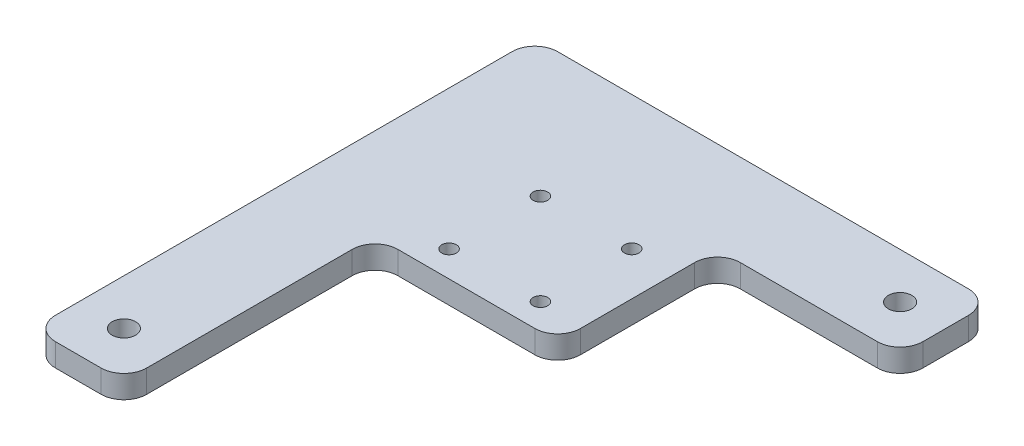
ISO-10303-21;
HEADER;
FILE_DESCRIPTION(('STEP AP214'),'2;1');
FILE_NAME('part.step','',(''),(''),'','','');
FILE_SCHEMA(('AUTOMOTIVE_DESIGN { 1 0 10303 214 1 1 1 1 }'));
ENDSEC;
DATA;
#1=APPLICATION_CONTEXT('core data for automotive mechanical design processes');
#2=APPLICATION_PROTOCOL_DEFINITION('international standard','automotive_design',2000,#1);
#3=PRODUCT_CONTEXT('',#1,'mechanical');
#4=PRODUCT('Part','Part','',(#3));
#5=PRODUCT_RELATED_PRODUCT_CATEGORY('part','',(#4));
#6=PRODUCT_DEFINITION_FORMATION('','',#4);
#7=PRODUCT_DEFINITION_CONTEXT('part definition',#1,'design');
#8=PRODUCT_DEFINITION('design','',#6,#7);
#9=PRODUCT_DEFINITION_SHAPE('','',#8);
#10=(LENGTH_UNIT() NAMED_UNIT(*) SI_UNIT(.MILLI.,.METRE.));
#11=(NAMED_UNIT(*) PLANE_ANGLE_UNIT() SI_UNIT($,.RADIAN.));
#12=(NAMED_UNIT(*) SI_UNIT($,.STERADIAN.) SOLID_ANGLE_UNIT());
#13=UNCERTAINTY_MEASURE_WITH_UNIT(LENGTH_MEASURE(1.E-05),#10,'distance_accuracy_value','');
#14=(GEOMETRIC_REPRESENTATION_CONTEXT(3) GLOBAL_UNCERTAINTY_ASSIGNED_CONTEXT((#13)) GLOBAL_UNIT_ASSIGNED_CONTEXT((#10,
#11,#12)) REPRESENTATION_CONTEXT('',''));
#15=CARTESIAN_POINT('',(0.,0.,0.));
#16=DIRECTION('',(0.,0.,1.));
#17=DIRECTION('',(1.,0.,0.));
#18=AXIS2_PLACEMENT_3D('',#15,#16,#17);
#19=CARTESIAN_POINT('',(0.,6.35,0.));
#20=DIRECTION('',(0.,-1.,0.));
#21=DIRECTION('',(0.,0.,-1.));
#22=AXIS2_PLACEMENT_3D('',#19,#20,#21);
#23=PLANE('',#22);
#24=CARTESIAN_POINT('',(-15.1823734729494,6.35,-16.8027870855148));
#25=DIRECTION('',(0.,1.,0.));
#26=DIRECTION('',(0.,0.,1.));
#27=AXIS2_PLACEMENT_3D('',#24,#25,#26);
#28=CIRCLE('',#27,2.01929999999999);
#29=CARTESIAN_POINT('',(-15.1823734729494,6.35,-14.7834870855148));
#30=VERTEX_POINT('',#29);
#31=EDGE_CURVE('E455',#30,#30,#28,.T.);
#32=ORIENTED_EDGE('',*,*,#31,.F.);
#33=EDGE_LOOP('',(#32));
#34=FACE_BOUND('',#33,.T.);
#35=CARTESIAN_POINT('',(-15.1823734729494,6.35,8.59721291448517));
#36=DIRECTION('',(0.,1.,0.));
#37=DIRECTION('',(0.,0.,1.));
#38=AXIS2_PLACEMENT_3D('',#35,#36,#37);
#39=CIRCLE('',#38,2.01929999999999);
#40=CARTESIAN_POINT('',(-15.1823734729494,6.35,10.6165129144852));
#41=VERTEX_POINT('',#40);
#42=EDGE_CURVE('E459',#41,#41,#39,.T.);
#43=ORIENTED_EDGE('',*,*,#42,.F.);
#44=EDGE_LOOP('',(#43));
#45=FACE_BOUND('',#44,.T.);
#46=CARTESIAN_POINT('',(10.2176265270506,6.35,8.59721291448517));
#47=DIRECTION('',(0.,1.,0.));
#48=DIRECTION('',(0.,0.,1.));
#49=AXIS2_PLACEMENT_3D('',#46,#47,#48);
#50=CIRCLE('',#49,2.01929999999999);
#51=CARTESIAN_POINT('',(10.2176265270506,6.35,10.6165129144852));
#52=VERTEX_POINT('',#51);
#53=EDGE_CURVE('E469',#52,#52,#50,.T.);
#54=ORIENTED_EDGE('',*,*,#53,.F.);
#55=EDGE_LOOP('',(#54));
#56=FACE_BOUND('',#55,.T.);
#57=CARTESIAN_POINT('',(10.2176265270506,6.35,-16.8027870855148));
#58=DIRECTION('',(0.,1.,0.));
#59=DIRECTION('',(0.,0.,1.));
#60=AXIS2_PLACEMENT_3D('',#57,#58,#59);
#61=CIRCLE('',#60,2.01929999999999);
#62=CARTESIAN_POINT('',(10.2176265270506,6.35,-14.7834870855148));
#63=VERTEX_POINT('',#62);
#64=EDGE_CURVE('E477',#63,#63,#61,.T.);
#65=ORIENTED_EDGE('',*,*,#64,.F.);
#66=EDGE_LOOP('',(#65));
#67=FACE_BOUND('',#66,.T.);
#68=DIRECTION('',(0.,0.,-1.));
#69=VECTOR('',#68,1.);
#70=CARTESIAN_POINT('',(73.0584040710506,6.35,-54.0137870855148));
#71=LINE('',#70,#69);
#72=CARTESIAN_POINT('',(73.0584040710506,6.35,-34.9637870855148));
#73=VERTEX_POINT('',#72);
#74=CARTESIAN_POINT('',(73.0584040710506,6.35,-47.6637870855148));
#75=VERTEX_POINT('',#74);
#76=EDGE_CURVE('E298',#73,#75,#71,.T.);
#77=ORIENTED_EDGE('',*,*,#76,.T.);
#78=CARTESIAN_POINT('',(66.7084040710506,6.35,-47.6637870855148));
#79=DIRECTION('',(0.,-1.,0.));
#80=DIRECTION('',(0.,0.,-1.));
#81=AXIS2_PLACEMENT_3D('',#78,#79,#80);
#82=CIRCLE('',#81,6.35);
#83=CARTESIAN_POINT('',(66.7084040710506,6.35,-54.0137870855148));
#84=VERTEX_POINT('',#83);
#85=EDGE_CURVE('E11',#75,#84,#82,.F.);
#86=ORIENTED_EDGE('',*,*,#85,.T.);
#87=DIRECTION('',(-1.,0.,0.));
#88=VECTOR('',#87,1.);
#89=CARTESIAN_POINT('',(-53.9415959289494,6.35,-54.0137870855148));
#90=LINE('',#89,#88);
#91=CARTESIAN_POINT('',(-47.5915959289494,6.35,-54.0137870855148));
#92=VERTEX_POINT('',#91);
#93=EDGE_CURVE('E295',#84,#92,#90,.T.);
#94=ORIENTED_EDGE('',*,*,#93,.T.);
#95=CARTESIAN_POINT('',(-47.5915959289494,6.35,-47.6637870855148));
#96=DIRECTION('',(0.,-1.,0.));
#97=DIRECTION('',(0.,0.,-1.));
#98=AXIS2_PLACEMENT_3D('',#95,#96,#97);
#99=CIRCLE('',#98,6.35);
#100=CARTESIAN_POINT('',(-53.9415959289494,6.35,-47.6637870855148));
#101=VERTEX_POINT('',#100);
#102=EDGE_CURVE('E209',#92,#101,#99,.F.);
#103=ORIENTED_EDGE('',*,*,#102,.T.);
#104=DIRECTION('',(0.,0.,1.));
#105=VECTOR('',#104,1.);
#106=CARTESIAN_POINT('',(-53.9415959289494,6.35,85.6862129144852));
#107=LINE('',#106,#105);
#108=CARTESIAN_POINT('',(-53.9415959289494,6.35,79.3362129144852));
#109=VERTEX_POINT('',#108);
#110=EDGE_CURVE('E291',#101,#109,#107,.T.);
#111=ORIENTED_EDGE('',*,*,#110,.T.);
#112=CARTESIAN_POINT('',(-47.5915959289494,6.35,79.3362129144852));
#113=DIRECTION('',(0.,-1.,0.));
#114=DIRECTION('',(0.,0.,-1.));
#115=AXIS2_PLACEMENT_3D('',#112,#113,#114);
#116=CIRCLE('',#115,6.35);
#117=CARTESIAN_POINT('',(-47.5915959289494,6.35,85.6862129144852));
#118=VERTEX_POINT('',#117);
#119=EDGE_CURVE('E222',#109,#118,#116,.F.);
#120=ORIENTED_EDGE('',*,*,#119,.T.);
#121=DIRECTION('',(1.,0.,0.));
#122=VECTOR('',#121,1.);
#123=CARTESIAN_POINT('',(-53.9415959289494,6.35,85.6862129144852));
#124=LINE('',#123,#122);
#125=CARTESIAN_POINT('',(-34.8915959289494,6.35,85.6862129144852));
#126=VERTEX_POINT('',#125);
#127=EDGE_CURVE('E287',#118,#126,#124,.T.);
#128=ORIENTED_EDGE('',*,*,#127,.T.);
#129=CARTESIAN_POINT('',(-34.8915959289494,6.35,79.3362129144852));
#130=DIRECTION('',(0.,-1.,0.));
#131=DIRECTION('',(0.,0.,-1.));
#132=AXIS2_PLACEMENT_3D('',#129,#130,#131);
#133=CIRCLE('',#132,6.35);
#134=CARTESIAN_POINT('',(-28.5415959289494,6.35,79.3362129144852));
#135=VERTEX_POINT('',#134);
#136=EDGE_CURVE('E235',#126,#135,#133,.F.);
#137=ORIENTED_EDGE('',*,*,#136,.T.);
#138=DIRECTION('',(0.,0.,-1.));
#139=VECTOR('',#138,1.);
#140=CARTESIAN_POINT('',(-28.5415959289494,6.35,15.8362129144852));
#141=LINE('',#140,#139);
#142=CARTESIAN_POINT('',(-28.5415959289494,6.35,22.1862129144852));
#143=VERTEX_POINT('',#142);
#144=EDGE_CURVE('E284',#135,#143,#141,.T.);
#145=ORIENTED_EDGE('',*,*,#144,.T.);
#146=CARTESIAN_POINT('',(-22.1915959289494,6.35,22.1862129144852));
#147=DIRECTION('',(0.,-1.,0.));
#148=DIRECTION('',(0.,0.,-1.));
#149=AXIS2_PLACEMENT_3D('',#146,#147,#148);
#150=CIRCLE('',#149,6.35);
#151=CARTESIAN_POINT('',(-22.1915959289494,6.35,15.8362129144852));
#152=VERTEX_POINT('',#151);
#153=EDGE_CURVE('E164',#143,#152,#150,.T.);
#154=ORIENTED_EDGE('',*,*,#153,.T.);
#155=DIRECTION('',(1.,0.,0.));
#156=VECTOR('',#155,1.);
#157=CARTESIAN_POINT('',(22.2584040710506,6.35,15.8362129144852));
#158=LINE('',#157,#156);
#159=CARTESIAN_POINT('',(15.9084040710506,6.35,15.8362129144852));
#160=VERTEX_POINT('',#159);
#161=EDGE_CURVE('E173',#152,#160,#158,.T.);
#162=ORIENTED_EDGE('',*,*,#161,.T.);
#163=CARTESIAN_POINT('',(15.9084040710506,6.35,9.48621291448515));
#164=DIRECTION('',(0.,-1.,0.));
#165=DIRECTION('',(0.,0.,-1.));
#166=AXIS2_PLACEMENT_3D('',#163,#164,#165);
#167=CIRCLE('',#166,6.35);
#168=CARTESIAN_POINT('',(22.2584040710506,6.35,9.48621291448515));
#169=VERTEX_POINT('',#168);
#170=EDGE_CURVE('E247',#160,#169,#167,.F.);
#171=ORIENTED_EDGE('',*,*,#170,.T.);
#172=DIRECTION('',(0.,0.,-1.));
#173=VECTOR('',#172,1.);
#174=CARTESIAN_POINT('',(22.2584040710506,6.35,15.8362129144852));
#175=LINE('',#174,#173);
#176=CARTESIAN_POINT('',(22.2584040710506,6.35,-22.2637870855148));
#177=VERTEX_POINT('',#176);
#178=EDGE_CURVE('E181',#169,#177,#175,.T.);
#179=ORIENTED_EDGE('',*,*,#178,.T.);
#180=CARTESIAN_POINT('',(28.6084040710506,6.35,-22.2637870855148));
#181=DIRECTION('',(0.,-1.,0.));
#182=DIRECTION('',(0.,0.,-1.));
#183=AXIS2_PLACEMENT_3D('',#180,#181,#182);
#184=CIRCLE('',#183,6.35);
#185=CARTESIAN_POINT('',(28.6084040710506,6.35,-28.6137870855148));
#186=VERTEX_POINT('',#185);
#187=EDGE_CURVE('E260',#177,#186,#184,.T.);
#188=ORIENTED_EDGE('',*,*,#187,.T.);
#189=DIRECTION('',(1.,0.,0.));
#190=VECTOR('',#189,1.);
#191=CARTESIAN_POINT('',(22.2584040710506,6.35,-28.6137870855148));
#192=LINE('',#191,#190);
#193=CARTESIAN_POINT('',(66.7084040710506,6.35,-28.6137870855148));
#194=VERTEX_POINT('',#193);
#195=EDGE_CURVE('E187',#186,#194,#192,.T.);
#196=ORIENTED_EDGE('',*,*,#195,.T.);
#197=CARTESIAN_POINT('',(66.7084040710506,6.35,-34.9637870855148));
#198=DIRECTION('',(0.,-1.,0.));
#199=DIRECTION('',(0.,0.,-1.));
#200=AXIS2_PLACEMENT_3D('',#197,#198,#199);
#201=CIRCLE('',#200,6.35);
#202=EDGE_CURVE('E273',#194,#73,#201,.F.);
#203=ORIENTED_EDGE('',*,*,#202,.T.);
#204=EDGE_LOOP('',(#77,#86,#94,#103,#111,#120,#128,#137,#145,#154,#162,#171,#179,#188,#196,#203));
#205=FACE_BOUND('',#204,.T.);
#206=CARTESIAN_POINT('',(-41.2415959289494,6.35,72.9862129144852));
#207=DIRECTION('',(0.,1.,0.));
#208=DIRECTION('',(0.,0.,1.));
#209=AXIS2_PLACEMENT_3D('',#206,#207,#208);
#210=CIRCLE('',#209,3.2639);
#211=CARTESIAN_POINT('',(-41.2415959289494,6.35,76.2501129144852));
#212=VERTEX_POINT('',#211);
#213=EDGE_CURVE('E314',#212,#212,#210,.T.);
#214=ORIENTED_EDGE('',*,*,#213,.F.);
#215=EDGE_LOOP('',(#214));
#216=FACE_BOUND('',#215,.T.);
#217=CARTESIAN_POINT('',(60.3584040710506,6.35,-41.3137870855148));
#218=DIRECTION('',(0.,1.,0.));
#219=DIRECTION('',(0.,0.,1.));
#220=AXIS2_PLACEMENT_3D('',#217,#218,#219);
#221=CIRCLE('',#220,3.26389999999999);
#222=CARTESIAN_POINT('',(60.3584040710506,6.35,-38.0498870855148));
#223=VERTEX_POINT('',#222);
#224=EDGE_CURVE('E486',#223,#223,#221,.T.);
#225=ORIENTED_EDGE('',*,*,#224,.F.);
#226=EDGE_LOOP('',(#225));
#227=FACE_BOUND('',#226,.T.);
#228=ADVANCED_FACE('F39',(#34,#45,#56,#67,#205,#216,#227),#23,.F.);
#229=CARTESIAN_POINT('',(0.,0.,0.));
#230=DIRECTION('',(0.,-1.,0.));
#231=DIRECTION('',(0.,0.,-1.));
#232=AXIS2_PLACEMENT_3D('',#229,#230,#231);
#233=PLANE('',#232);
#234=CARTESIAN_POINT('',(-15.1823734729494,0.,-16.8027870855148));
#235=DIRECTION('',(0.,1.,0.));
#236=DIRECTION('',(0.,0.,1.));
#237=AXIS2_PLACEMENT_3D('',#234,#235,#236);
#238=CIRCLE('',#237,2.0193);
#239=CARTESIAN_POINT('',(-15.1823734729494,0.,-14.7834870855148));
#240=VERTEX_POINT('',#239);
#241=EDGE_CURVE('E453',#240,#240,#238,.T.);
#242=ORIENTED_EDGE('',*,*,#241,.T.);
#243=EDGE_LOOP('',(#242));
#244=FACE_BOUND('',#243,.T.);
#245=CARTESIAN_POINT('',(-15.1823734729494,0.,8.59721291448517));
#246=DIRECTION('',(0.,1.,0.));
#247=DIRECTION('',(0.,0.,1.));
#248=AXIS2_PLACEMENT_3D('',#245,#246,#247);
#249=CIRCLE('',#248,2.0193);
#250=CARTESIAN_POINT('',(-15.1823734729494,0.,10.6165129144852));
#251=VERTEX_POINT('',#250);
#252=EDGE_CURVE('E465',#251,#251,#249,.T.);
#253=ORIENTED_EDGE('',*,*,#252,.T.);
#254=EDGE_LOOP('',(#253));
#255=FACE_BOUND('',#254,.T.);
#256=CARTESIAN_POINT('',(10.2176265270506,0.,8.59721291448517));
#257=DIRECTION('',(0.,1.,0.));
#258=DIRECTION('',(0.,0.,1.));
#259=AXIS2_PLACEMENT_3D('',#256,#257,#258);
#260=CIRCLE('',#259,2.0193);
#261=CARTESIAN_POINT('',(10.2176265270506,0.,10.6165129144852));
#262=VERTEX_POINT('',#261);
#263=EDGE_CURVE('E473',#262,#262,#260,.T.);
#264=ORIENTED_EDGE('',*,*,#263,.T.);
#265=EDGE_LOOP('',(#264));
#266=FACE_BOUND('',#265,.T.);
#267=CARTESIAN_POINT('',(10.2176265270506,0.,-16.8027870855148));
#268=DIRECTION('',(0.,1.,0.));
#269=DIRECTION('',(0.,0.,1.));
#270=AXIS2_PLACEMENT_3D('',#267,#268,#269);
#271=CIRCLE('',#270,2.0193);
#272=CARTESIAN_POINT('',(10.2176265270506,0.,-14.7834870855148));
#273=VERTEX_POINT('',#272);
#274=EDGE_CURVE('E481',#273,#273,#271,.T.);
#275=ORIENTED_EDGE('',*,*,#274,.T.);
#276=EDGE_LOOP('',(#275));
#277=FACE_BOUND('',#276,.T.);
#278=CARTESIAN_POINT('',(-41.2415959289494,0.,72.9862129144852));
#279=DIRECTION('',(0.,1.,0.));
#280=DIRECTION('',(0.,0.,1.));
#281=AXIS2_PLACEMENT_3D('',#278,#279,#280);
#282=CIRCLE('',#281,3.2639);
#283=CARTESIAN_POINT('',(-41.2415959289494,0.,76.2501129144852));
#284=VERTEX_POINT('',#283);
#285=EDGE_CURVE('E489',#284,#284,#282,.T.);
#286=ORIENTED_EDGE('',*,*,#285,.T.);
#287=EDGE_LOOP('',(#286));
#288=FACE_BOUND('',#287,.T.);
#289=DIRECTION('',(-1.,0.,0.));
#290=VECTOR('',#289,1.);
#291=CARTESIAN_POINT('',(-53.9415959289494,0.,-54.0137870855148));
#292=LINE('',#291,#290);
#293=CARTESIAN_POINT('',(66.7084040710506,0.,-54.0137870855148));
#294=VERTEX_POINT('',#293);
#295=CARTESIAN_POINT('',(-47.5915959289494,0.,-54.0137870855148));
#296=VERTEX_POINT('',#295);
#297=EDGE_CURVE('E321',#294,#296,#292,.T.);
#298=ORIENTED_EDGE('',*,*,#297,.F.);
#299=CARTESIAN_POINT('',(66.7084040710506,0.,-47.6637870855148));
#300=DIRECTION('',(0.,-1.,0.));
#301=DIRECTION('',(0.,0.,-1.));
#302=AXIS2_PLACEMENT_3D('',#299,#300,#301);
#303=CIRCLE('',#302,6.35);
#304=CARTESIAN_POINT('',(73.0584040710506,0.,-47.6637870855148));
#305=VERTEX_POINT('',#304);
#306=EDGE_CURVE('E62',#294,#305,#303,.T.);
#307=ORIENTED_EDGE('',*,*,#306,.T.);
#308=DIRECTION('',(0.,0.,-1.));
#309=VECTOR('',#308,1.);
#310=CARTESIAN_POINT('',(73.0584040710506,0.,-54.0137870855148));
#311=LINE('',#310,#309);
#312=CARTESIAN_POINT('',(73.0584040710506,0.,-34.9637870855148));
#313=VERTEX_POINT('',#312);
#314=EDGE_CURVE('E318',#313,#305,#311,.T.);
#315=ORIENTED_EDGE('',*,*,#314,.F.);
#316=CARTESIAN_POINT('',(66.7084040710506,0.,-34.9637870855148));
#317=DIRECTION('',(0.,-1.,0.));
#318=DIRECTION('',(0.,0.,-1.));
#319=AXIS2_PLACEMENT_3D('',#316,#317,#318);
#320=CIRCLE('',#319,6.35);
#321=CARTESIAN_POINT('',(66.7084040710506,0.,-28.6137870855148));
#322=VERTEX_POINT('',#321);
#323=EDGE_CURVE('E267',#313,#322,#320,.T.);
#324=ORIENTED_EDGE('',*,*,#323,.T.);
#325=DIRECTION('',(1.,0.,0.));
#326=VECTOR('',#325,1.);
#327=CARTESIAN_POINT('',(22.2584040710506,0.,-28.6137870855148));
#328=LINE('',#327,#326);
#329=CARTESIAN_POINT('',(28.6084040710506,0.,-28.6137870855148));
#330=VERTEX_POINT('',#329);
#331=EDGE_CURVE('E313',#330,#322,#328,.T.);
#332=ORIENTED_EDGE('',*,*,#331,.F.);
#333=CARTESIAN_POINT('',(28.6084040710506,0.,-22.2637870855148));
#334=DIRECTION('',(0.,-1.,0.));
#335=DIRECTION('',(0.,0.,-1.));
#336=AXIS2_PLACEMENT_3D('',#333,#334,#335);
#337=CIRCLE('',#336,6.35);
#338=CARTESIAN_POINT('',(22.2584040710506,0.,-22.2637870855148));
#339=VERTEX_POINT('',#338);
#340=EDGE_CURVE('E257',#330,#339,#337,.F.);
#341=ORIENTED_EDGE('',*,*,#340,.T.);
#342=DIRECTION('',(0.,0.,-1.));
#343=VECTOR('',#342,1.);
#344=CARTESIAN_POINT('',(22.2584040710506,0.,15.8362129144852));
#345=LINE('',#344,#343);
#346=CARTESIAN_POINT('',(22.2584040710506,0.,9.48621291448515));
#347=VERTEX_POINT('',#346);
#348=EDGE_CURVE('E309',#347,#339,#345,.T.);
#349=ORIENTED_EDGE('',*,*,#348,.F.);
#350=CARTESIAN_POINT('',(15.9084040710506,0.,9.48621291448515));
#351=DIRECTION('',(0.,-1.,0.));
#352=DIRECTION('',(0.,0.,-1.));
#353=AXIS2_PLACEMENT_3D('',#350,#351,#352);
#354=CIRCLE('',#353,6.35);
#355=CARTESIAN_POINT('',(15.9084040710506,0.,15.8362129144852));
#356=VERTEX_POINT('',#355);
#357=EDGE_CURVE('E179',#347,#356,#354,.T.);
#358=ORIENTED_EDGE('',*,*,#357,.T.);
#359=DIRECTION('',(1.,0.,0.));
#360=VECTOR('',#359,1.);
#361=CARTESIAN_POINT('',(22.2584040710506,0.,15.8362129144852));
#362=LINE('',#361,#360);
#363=CARTESIAN_POINT('',(-22.1915959289494,0.,15.8362129144852));
#364=VERTEX_POINT('',#363);
#365=EDGE_CURVE('E170',#364,#356,#362,.T.);
#366=ORIENTED_EDGE('',*,*,#365,.F.);
#367=CARTESIAN_POINT('',(-22.1915959289494,0.,22.1862129144852));
#368=DIRECTION('',(0.,-1.,0.));
#369=DIRECTION('',(0.,0.,-1.));
#370=AXIS2_PLACEMENT_3D('',#367,#368,#369);
#371=CIRCLE('',#370,6.35);
#372=CARTESIAN_POINT('',(-28.5415959289494,0.,22.1862129144852));
#373=VERTEX_POINT('',#372);
#374=EDGE_CURVE('E154',#364,#373,#371,.F.);
#375=ORIENTED_EDGE('',*,*,#374,.T.);
#376=DIRECTION('',(0.,0.,-1.));
#377=VECTOR('',#376,1.);
#378=CARTESIAN_POINT('',(-28.5415959289494,0.,15.8362129144852));
#379=LINE('',#378,#377);
#380=CARTESIAN_POINT('',(-28.5415959289494,0.,79.3362129144852));
#381=VERTEX_POINT('',#380);
#382=EDGE_CURVE('E182',#381,#373,#379,.T.);
#383=ORIENTED_EDGE('',*,*,#382,.F.);
#384=CARTESIAN_POINT('',(-34.8915959289494,0.,79.3362129144852));
#385=DIRECTION('',(0.,-1.,0.));
#386=DIRECTION('',(0.,0.,-1.));
#387=AXIS2_PLACEMENT_3D('',#384,#385,#386);
#388=CIRCLE('',#387,6.35);
#389=CARTESIAN_POINT('',(-34.8915959289494,0.,85.6862129144852));
#390=VERTEX_POINT('',#389);
#391=EDGE_CURVE('E229',#381,#390,#388,.T.);
#392=ORIENTED_EDGE('',*,*,#391,.T.);
#393=DIRECTION('',(1.,0.,0.));
#394=VECTOR('',#393,1.);
#395=CARTESIAN_POINT('',(-53.9415959289494,0.,85.6862129144852));
#396=LINE('',#395,#394);
#397=CARTESIAN_POINT('',(-47.5915959289494,0.,85.6862129144852));
#398=VERTEX_POINT('',#397);
#399=EDGE_CURVE('E189',#398,#390,#396,.T.);
#400=ORIENTED_EDGE('',*,*,#399,.F.);
#401=CARTESIAN_POINT('',(-47.5915959289494,0.,79.3362129144852));
#402=DIRECTION('',(0.,-1.,0.));
#403=DIRECTION('',(0.,0.,-1.));
#404=AXIS2_PLACEMENT_3D('',#401,#402,#403);
#405=CIRCLE('',#404,6.35);
#406=CARTESIAN_POINT('',(-53.9415959289494,0.,79.3362129144852));
#407=VERTEX_POINT('',#406);
#408=EDGE_CURVE('E216',#398,#407,#405,.T.);
#409=ORIENTED_EDGE('',*,*,#408,.T.);
#410=DIRECTION('',(0.,0.,1.));
#411=VECTOR('',#410,1.);
#412=CARTESIAN_POINT('',(-53.9415959289494,0.,85.6862129144852));
#413=LINE('',#412,#411);
#414=CARTESIAN_POINT('',(-53.9415959289494,0.,-47.6637870855148));
#415=VERTEX_POINT('',#414);
#416=EDGE_CURVE('E324',#415,#407,#413,.T.);
#417=ORIENTED_EDGE('',*,*,#416,.F.);
#418=CARTESIAN_POINT('',(-47.5915959289494,0.,-47.6637870855148));
#419=DIRECTION('',(0.,-1.,0.));
#420=DIRECTION('',(0.,0.,-1.));
#421=AXIS2_PLACEMENT_3D('',#418,#419,#420);
#422=CIRCLE('',#421,6.35);
#423=EDGE_CURVE('E201',#415,#296,#422,.T.);
#424=ORIENTED_EDGE('',*,*,#423,.T.);
#425=EDGE_LOOP('',(#298,#307,#315,#324,#332,#341,#349,#358,#366,#375,#383,#392,#400,#409,#417,#424));
#426=FACE_BOUND('',#425,.T.);
#427=CARTESIAN_POINT('',(60.3584040710506,0.,-41.3137870855148));
#428=DIRECTION('',(0.,1.,0.));
#429=DIRECTION('',(0.,0.,1.));
#430=AXIS2_PLACEMENT_3D('',#427,#428,#429);
#431=CIRCLE('',#430,3.26389999999999);
#432=CARTESIAN_POINT('',(60.3584040710506,0.,-38.0498870855148));
#433=VERTEX_POINT('',#432);
#434=EDGE_CURVE('E485',#433,#433,#431,.T.);
#435=ORIENTED_EDGE('',*,*,#434,.T.);
#436=EDGE_LOOP('',(#435));
#437=FACE_BOUND('',#436,.T.);
#438=ADVANCED_FACE('F176',(#244,#255,#266,#277,#288,#426,#437),#233,.T.);
#439=CARTESIAN_POINT('',(22.2584040710506,6.35,15.8362129144852));
#440=DIRECTION('',(-1.,0.,0.));
#441=DIRECTION('',(0.,0.,1.));
#442=AXIS2_PLACEMENT_3D('',#439,#440,#441);
#443=PLANE('',#442);
#444=ORIENTED_EDGE('',*,*,#348,.T.);
#445=DIRECTION('',(0.,-1.,0.));
#446=VECTOR('',#445,1.);
#447=CARTESIAN_POINT('',(22.2584040710506,6.35,-22.2637870855148));
#448=LINE('',#447,#446);
#449=EDGE_CURVE('E254',#339,#177,#448,.F.);
#450=ORIENTED_EDGE('',*,*,#449,.T.);
#451=ORIENTED_EDGE('',*,*,#178,.F.);
#452=DIRECTION('',(0.,-1.,0.));
#453=VECTOR('',#452,1.);
#454=CARTESIAN_POINT('',(22.2584040710506,6.35,9.48621291448515));
#455=LINE('',#454,#453);
#456=EDGE_CURVE('E238',#169,#347,#455,.T.);
#457=ORIENTED_EDGE('',*,*,#456,.T.);
#458=EDGE_LOOP('',(#444,#450,#451,#457));
#459=FACE_BOUND('',#458,.T.);
#460=ADVANCED_FACE('F349',(#459),#443,.F.);
#461=CARTESIAN_POINT('',(22.2584040710506,6.35,-28.6137870855148));
#462=DIRECTION('',(0.,0.,-1.));
#463=DIRECTION('',(-1.,0.,0.));
#464=AXIS2_PLACEMENT_3D('',#461,#462,#463);
#465=PLANE('',#464);
#466=ORIENTED_EDGE('',*,*,#331,.T.);
#467=DIRECTION('',(0.,-1.,0.));
#468=VECTOR('',#467,1.);
#469=CARTESIAN_POINT('',(66.7084040710506,6.35,-28.6137870855148));
#470=LINE('',#469,#468);
#471=EDGE_CURVE('E270',#322,#194,#470,.F.);
#472=ORIENTED_EDGE('',*,*,#471,.T.);
#473=ORIENTED_EDGE('',*,*,#195,.F.);
#474=DIRECTION('',(0.,-1.,0.));
#475=VECTOR('',#474,1.);
#476=CARTESIAN_POINT('',(28.6084040710506,0.,-28.6137870855148));
#477=LINE('',#476,#475);
#478=EDGE_CURVE('E250',#186,#330,#477,.T.);
#479=ORIENTED_EDGE('',*,*,#478,.T.);
#480=EDGE_LOOP('',(#466,#472,#473,#479));
#481=FACE_BOUND('',#480,.T.);
#482=ADVANCED_FACE('F357',(#481),#465,.F.);
#483=CARTESIAN_POINT('',(73.0584040710506,6.35,-54.0137870855148));
#484=DIRECTION('',(-1.,0.,0.));
#485=DIRECTION('',(0.,0.,1.));
#486=AXIS2_PLACEMENT_3D('',#483,#484,#485);
#487=PLANE('',#486);
#488=ORIENTED_EDGE('',*,*,#314,.T.);
#489=DIRECTION('',(0.,-1.,0.));
#490=VECTOR('',#489,1.);
#491=CARTESIAN_POINT('',(73.0584040710506,6.35,-47.6637870855148));
#492=LINE('',#491,#490);
#493=EDGE_CURVE('E48',#305,#75,#492,.F.);
#494=ORIENTED_EDGE('',*,*,#493,.T.);
#495=ORIENTED_EDGE('',*,*,#76,.F.);
#496=DIRECTION('',(0.,-1.,0.));
#497=VECTOR('',#496,1.);
#498=CARTESIAN_POINT('',(73.0584040710506,6.35,-34.9637870855148));
#499=LINE('',#498,#497);
#500=EDGE_CURVE('E263',#73,#313,#499,.T.);
#501=ORIENTED_EDGE('',*,*,#500,.T.);
#502=EDGE_LOOP('',(#488,#494,#495,#501));
#503=FACE_BOUND('',#502,.T.);
#504=ADVANCED_FACE('F363',(#503),#487,.F.);
#505=CARTESIAN_POINT('',(-53.9415959289494,6.35,-54.0137870855148));
#506=DIRECTION('',(0.,0.,1.));
#507=DIRECTION('',(1.,0.,0.));
#508=AXIS2_PLACEMENT_3D('',#505,#506,#507);
#509=PLANE('',#508);
#510=ORIENTED_EDGE('',*,*,#93,.F.);
#511=DIRECTION('',(0.,-1.,0.));
#512=VECTOR('',#511,1.);
#513=CARTESIAN_POINT('',(66.7084040710506,6.35,-54.0137870855148));
#514=LINE('',#513,#512);
#515=EDGE_CURVE('E276',#84,#294,#514,.T.);
#516=ORIENTED_EDGE('',*,*,#515,.T.);
#517=ORIENTED_EDGE('',*,*,#297,.T.);
#518=DIRECTION('',(0.,-1.,0.));
#519=VECTOR('',#518,1.);
#520=CARTESIAN_POINT('',(-47.5915959289494,6.35,-54.0137870855148));
#521=LINE('',#520,#519);
#522=EDGE_CURVE('E205',#296,#92,#521,.F.);
#523=ORIENTED_EDGE('',*,*,#522,.T.);
#524=EDGE_LOOP('',(#510,#516,#517,#523));
#525=FACE_BOUND('',#524,.T.);
#526=ADVANCED_FACE('F368',(#525),#509,.F.);
#527=CARTESIAN_POINT('',(-53.9415959289494,6.35,85.6862129144852));
#528=DIRECTION('',(1.,0.,0.));
#529=DIRECTION('',(0.,0.,-1.));
#530=AXIS2_PLACEMENT_3D('',#527,#528,#529);
#531=PLANE('',#530);
#532=ORIENTED_EDGE('',*,*,#416,.T.);
#533=DIRECTION('',(0.,-1.,0.));
#534=VECTOR('',#533,1.);
#535=CARTESIAN_POINT('',(-53.9415959289494,6.35,79.3362129144852));
#536=LINE('',#535,#534);
#537=EDGE_CURVE('E219',#407,#109,#536,.F.);
#538=ORIENTED_EDGE('',*,*,#537,.T.);
#539=ORIENTED_EDGE('',*,*,#110,.F.);
#540=DIRECTION('',(0.,-1.,0.));
#541=VECTOR('',#540,1.);
#542=CARTESIAN_POINT('',(-53.9415959289494,6.35,-47.6637870855148));
#543=LINE('',#542,#541);
#544=EDGE_CURVE('E197',#101,#415,#543,.T.);
#545=ORIENTED_EDGE('',*,*,#544,.T.);
#546=EDGE_LOOP('',(#532,#538,#539,#545));
#547=FACE_BOUND('',#546,.T.);
#548=ADVANCED_FACE('F377',(#547),#531,.F.);
#549=CARTESIAN_POINT('',(-53.9415959289494,6.35,85.6862129144852));
#550=DIRECTION('',(0.,0.,-1.));
#551=DIRECTION('',(-1.,0.,0.));
#552=AXIS2_PLACEMENT_3D('',#549,#550,#551);
#553=PLANE('',#552);
#554=ORIENTED_EDGE('',*,*,#399,.T.);
#555=DIRECTION('',(0.,-1.,0.));
#556=VECTOR('',#555,1.);
#557=CARTESIAN_POINT('',(-34.8915959289494,6.35,85.6862129144852));
#558=LINE('',#557,#556);
#559=EDGE_CURVE('E232',#390,#126,#558,.F.);
#560=ORIENTED_EDGE('',*,*,#559,.T.);
#561=ORIENTED_EDGE('',*,*,#127,.F.);
#562=DIRECTION('',(0.,-1.,0.));
#563=VECTOR('',#562,1.);
#564=CARTESIAN_POINT('',(-47.5915959289494,6.35,85.6862129144852));
#565=LINE('',#564,#563);
#566=EDGE_CURVE('E212',#118,#398,#565,.T.);
#567=ORIENTED_EDGE('',*,*,#566,.T.);
#568=EDGE_LOOP('',(#554,#560,#561,#567));
#569=FACE_BOUND('',#568,.T.);
#570=ADVANCED_FACE('F332',(#569),#553,.F.);
#571=CARTESIAN_POINT('',(-28.5415959289494,6.35,15.8362129144852));
#572=DIRECTION('',(-1.,0.,0.));
#573=DIRECTION('',(0.,0.,1.));
#574=AXIS2_PLACEMENT_3D('',#571,#572,#573);
#575=PLANE('',#574);
#576=ORIENTED_EDGE('',*,*,#144,.F.);
#577=DIRECTION('',(0.,-1.,0.));
#578=VECTOR('',#577,1.);
#579=CARTESIAN_POINT('',(-28.5415959289494,6.35,79.3362129144852));
#580=LINE('',#579,#578);
#581=EDGE_CURVE('E225',#135,#381,#580,.T.);
#582=ORIENTED_EDGE('',*,*,#581,.T.);
#583=ORIENTED_EDGE('',*,*,#382,.T.);
#584=DIRECTION('',(0.,-1.,0.));
#585=VECTOR('',#584,1.);
#586=CARTESIAN_POINT('',(-28.5415959289494,6.35,22.1862129144852));
#587=LINE('',#586,#585);
#588=EDGE_CURVE('E160',#373,#143,#587,.F.);
#589=ORIENTED_EDGE('',*,*,#588,.T.);
#590=EDGE_LOOP('',(#576,#582,#583,#589));
#591=FACE_BOUND('',#590,.T.);
#592=ADVANCED_FACE('F342',(#591),#575,.F.);
#593=CARTESIAN_POINT('',(22.2584040710506,6.35,15.8362129144852));
#594=DIRECTION('',(0.,0.,-1.));
#595=DIRECTION('',(-1.,0.,0.));
#596=AXIS2_PLACEMENT_3D('',#593,#594,#595);
#597=PLANE('',#596);
#598=ORIENTED_EDGE('',*,*,#365,.T.);
#599=DIRECTION('',(0.,-1.,0.));
#600=VECTOR('',#599,1.);
#601=CARTESIAN_POINT('',(15.9084040710506,6.35,15.8362129144852));
#602=LINE('',#601,#600);
#603=EDGE_CURVE('E244',#356,#160,#602,.F.);
#604=ORIENTED_EDGE('',*,*,#603,.T.);
#605=ORIENTED_EDGE('',*,*,#161,.F.);
#606=DIRECTION('',(0.,-1.,0.));
#607=VECTOR('',#606,1.);
#608=CARTESIAN_POINT('',(-22.1915959289494,0.,15.8362129144852));
#609=LINE('',#608,#607);
#610=EDGE_CURVE('E158',#152,#364,#609,.T.);
#611=ORIENTED_EDGE('',*,*,#610,.T.);
#612=EDGE_LOOP('',(#598,#604,#605,#611));
#613=FACE_BOUND('',#612,.T.);
#614=ADVANCED_FACE('F169',(#613),#597,.F.);
#615=CARTESIAN_POINT('',(-41.2415959289494,6.35,72.9862129144852));
#616=DIRECTION('',(0.,-1.,0.));
#617=DIRECTION('',(0.,0.,-1.));
#618=AXIS2_PLACEMENT_3D('',#615,#616,#617);
#619=CYLINDRICAL_SURFACE('',#618,3.2639);
#620=ORIENTED_EDGE('',*,*,#213,.T.);
#621=EDGE_LOOP('',(#620));
#622=FACE_BOUND('',#621,.T.);
#623=ORIENTED_EDGE('',*,*,#285,.F.);
#624=EDGE_LOOP('',(#623));
#625=FACE_BOUND('',#624,.T.);
#626=ADVANCED_FACE('F401',(#622,#625),#619,.F.);
#627=CARTESIAN_POINT('',(60.3584040710506,6.35,-41.3137870855148));
#628=DIRECTION('',(0.,-1.,0.));
#629=DIRECTION('',(0.,0.,-1.));
#630=AXIS2_PLACEMENT_3D('',#627,#628,#629);
#631=CYLINDRICAL_SURFACE('',#630,3.26389999999999);
#632=ORIENTED_EDGE('',*,*,#224,.T.);
#633=EDGE_LOOP('',(#632));
#634=FACE_BOUND('',#633,.T.);
#635=ORIENTED_EDGE('',*,*,#434,.F.);
#636=EDGE_LOOP('',(#635));
#637=FACE_BOUND('',#636,.T.);
#638=ADVANCED_FACE('F421',(#634,#637),#631,.F.);
#639=CARTESIAN_POINT('',(-22.1915959289494,6.35,22.1862129144852));
#640=DIRECTION('',(0.,1.,0.));
#641=DIRECTION('',(0.,0.,1.));
#642=AXIS2_PLACEMENT_3D('',#639,#640,#641);
#643=CYLINDRICAL_SURFACE('',#642,6.35);
#644=ORIENTED_EDGE('',*,*,#153,.F.);
#645=ORIENTED_EDGE('',*,*,#588,.F.);
#646=ORIENTED_EDGE('',*,*,#374,.F.);
#647=ORIENTED_EDGE('',*,*,#610,.F.);
#648=EDGE_LOOP('',(#644,#645,#646,#647));
#649=FACE_BOUND('',#648,.T.);
#650=ADVANCED_FACE('F157',(#649),#643,.F.);
#651=CARTESIAN_POINT('',(-47.5915959289494,6.35,-47.6637870855148));
#652=DIRECTION('',(0.,-1.,0.));
#653=DIRECTION('',(0.,0.,-1.));
#654=AXIS2_PLACEMENT_3D('',#651,#652,#653);
#655=CYLINDRICAL_SURFACE('',#654,6.35);
#656=ORIENTED_EDGE('',*,*,#102,.F.);
#657=ORIENTED_EDGE('',*,*,#522,.F.);
#658=ORIENTED_EDGE('',*,*,#423,.F.);
#659=ORIENTED_EDGE('',*,*,#544,.F.);
#660=EDGE_LOOP('',(#656,#657,#658,#659));
#661=FACE_BOUND('',#660,.T.);
#662=ADVANCED_FACE('F373',(#661),#655,.T.);
#663=CARTESIAN_POINT('',(-47.5915959289494,6.35,79.3362129144852));
#664=DIRECTION('',(0.,-1.,0.));
#665=DIRECTION('',(0.,0.,-1.));
#666=AXIS2_PLACEMENT_3D('',#663,#664,#665);
#667=CYLINDRICAL_SURFACE('',#666,6.35);
#668=ORIENTED_EDGE('',*,*,#119,.F.);
#669=ORIENTED_EDGE('',*,*,#537,.F.);
#670=ORIENTED_EDGE('',*,*,#408,.F.);
#671=ORIENTED_EDGE('',*,*,#566,.F.);
#672=EDGE_LOOP('',(#668,#669,#670,#671));
#673=FACE_BOUND('',#672,.T.);
#674=ADVANCED_FACE('F381',(#673),#667,.T.);
#675=CARTESIAN_POINT('',(-34.8915959289494,6.35,79.3362129144852));
#676=DIRECTION('',(0.,-1.,0.));
#677=DIRECTION('',(0.,0.,-1.));
#678=AXIS2_PLACEMENT_3D('',#675,#676,#677);
#679=CYLINDRICAL_SURFACE('',#678,6.35);
#680=ORIENTED_EDGE('',*,*,#136,.F.);
#681=ORIENTED_EDGE('',*,*,#559,.F.);
#682=ORIENTED_EDGE('',*,*,#391,.F.);
#683=ORIENTED_EDGE('',*,*,#581,.F.);
#684=EDGE_LOOP('',(#680,#681,#682,#683));
#685=FACE_BOUND('',#684,.T.);
#686=ADVANCED_FACE('F337',(#685),#679,.T.);
#687=CARTESIAN_POINT('',(15.9084040710506,6.35,9.48621291448515));
#688=DIRECTION('',(0.,-1.,0.));
#689=DIRECTION('',(0.,0.,-1.));
#690=AXIS2_PLACEMENT_3D('',#687,#688,#689);
#691=CYLINDRICAL_SURFACE('',#690,6.35);
#692=ORIENTED_EDGE('',*,*,#170,.F.);
#693=ORIENTED_EDGE('',*,*,#603,.F.);
#694=ORIENTED_EDGE('',*,*,#357,.F.);
#695=ORIENTED_EDGE('',*,*,#456,.F.);
#696=EDGE_LOOP('',(#692,#693,#694,#695));
#697=FACE_BOUND('',#696,.T.);
#698=ADVANCED_FACE('F347',(#697),#691,.T.);
#699=CARTESIAN_POINT('',(28.6084040710506,6.35,-22.2637870855148));
#700=DIRECTION('',(0.,1.,0.));
#701=DIRECTION('',(0.,0.,1.));
#702=AXIS2_PLACEMENT_3D('',#699,#700,#701);
#703=CYLINDRICAL_SURFACE('',#702,6.35);
#704=ORIENTED_EDGE('',*,*,#187,.F.);
#705=ORIENTED_EDGE('',*,*,#449,.F.);
#706=ORIENTED_EDGE('',*,*,#340,.F.);
#707=ORIENTED_EDGE('',*,*,#478,.F.);
#708=EDGE_LOOP('',(#704,#705,#706,#707));
#709=FACE_BOUND('',#708,.T.);
#710=ADVANCED_FACE('F355',(#709),#703,.F.);
#711=CARTESIAN_POINT('',(66.7084040710506,6.35,-34.9637870855148));
#712=DIRECTION('',(0.,-1.,0.));
#713=DIRECTION('',(0.,0.,-1.));
#714=AXIS2_PLACEMENT_3D('',#711,#712,#713);
#715=CYLINDRICAL_SURFACE('',#714,6.35);
#716=ORIENTED_EDGE('',*,*,#202,.F.);
#717=ORIENTED_EDGE('',*,*,#471,.F.);
#718=ORIENTED_EDGE('',*,*,#323,.F.);
#719=ORIENTED_EDGE('',*,*,#500,.F.);
#720=EDGE_LOOP('',(#716,#717,#718,#719));
#721=FACE_BOUND('',#720,.T.);
#722=ADVANCED_FACE('F360',(#721),#715,.T.);
#723=CARTESIAN_POINT('',(66.7084040710506,6.35,-47.6637870855148));
#724=DIRECTION('',(0.,-1.,0.));
#725=DIRECTION('',(0.,0.,-1.));
#726=AXIS2_PLACEMENT_3D('',#723,#724,#725);
#727=CYLINDRICAL_SURFACE('',#726,6.35);
#728=ORIENTED_EDGE('',*,*,#85,.F.);
#729=ORIENTED_EDGE('',*,*,#493,.F.);
#730=ORIENTED_EDGE('',*,*,#306,.F.);
#731=ORIENTED_EDGE('',*,*,#515,.F.);
#732=EDGE_LOOP('',(#728,#729,#730,#731));
#733=FACE_BOUND('',#732,.T.);
#734=ADVANCED_FACE('F41',(#733),#727,.T.);
#735=CARTESIAN_POINT('',(10.2176265270506,6.35,-16.8027870855148));
#736=DIRECTION('',(0.,1.,0.));
#737=DIRECTION('',(0.,0.,1.));
#738=AXIS2_PLACEMENT_3D('',#735,#736,#737);
#739=CYLINDRICAL_SURFACE('',#738,2.01929999999999);
#740=ORIENTED_EDGE('',*,*,#274,.F.);
#741=EDGE_LOOP('',(#740));
#742=FACE_BOUND('',#741,.T.);
#743=ORIENTED_EDGE('',*,*,#64,.T.);
#744=EDGE_LOOP('',(#743));
#745=FACE_BOUND('',#744,.T.);
#746=ADVANCED_FACE('F433',(#742,#745),#739,.F.);
#747=CARTESIAN_POINT('',(10.2176265270506,6.35,8.59721291448517));
#748=DIRECTION('',(0.,1.,0.));
#749=DIRECTION('',(0.,0.,1.));
#750=AXIS2_PLACEMENT_3D('',#747,#748,#749);
#751=CYLINDRICAL_SURFACE('',#750,2.01929999999999);
#752=ORIENTED_EDGE('',*,*,#263,.F.);
#753=EDGE_LOOP('',(#752));
#754=FACE_BOUND('',#753,.T.);
#755=ORIENTED_EDGE('',*,*,#53,.T.);
#756=EDGE_LOOP('',(#755));
#757=FACE_BOUND('',#756,.T.);
#758=ADVANCED_FACE('F436',(#754,#757),#751,.F.);
#759=CARTESIAN_POINT('',(-15.1823734729494,6.35,8.59721291448517));
#760=DIRECTION('',(0.,1.,0.));
#761=DIRECTION('',(0.,0.,1.));
#762=AXIS2_PLACEMENT_3D('',#759,#760,#761);
#763=CYLINDRICAL_SURFACE('',#762,2.01929999999999);
#764=ORIENTED_EDGE('',*,*,#252,.F.);
#765=EDGE_LOOP('',(#764));
#766=FACE_BOUND('',#765,.T.);
#767=ORIENTED_EDGE('',*,*,#42,.T.);
#768=EDGE_LOOP('',(#767));
#769=FACE_BOUND('',#768,.T.);
#770=ADVANCED_FACE('F440',(#766,#769),#763,.F.);
#771=CARTESIAN_POINT('',(-15.1823734729494,6.35,-16.8027870855148));
#772=DIRECTION('',(0.,1.,0.));
#773=DIRECTION('',(0.,0.,1.));
#774=AXIS2_PLACEMENT_3D('',#771,#772,#773);
#775=CYLINDRICAL_SURFACE('',#774,2.01929999999999);
#776=ORIENTED_EDGE('',*,*,#241,.F.);
#777=EDGE_LOOP('',(#776));
#778=FACE_BOUND('',#777,.T.);
#779=ORIENTED_EDGE('',*,*,#31,.T.);
#780=EDGE_LOOP('',(#779));
#781=FACE_BOUND('',#780,.T.);
#782=ADVANCED_FACE('F444',(#778,#781),#775,.F.);
#783=CLOSED_SHELL('',(#228,#438,#460,#482,#504,#526,#548,#570,#592,#614,#626,#638,#650,#662,
#674,#686,#698,#710,#722,#734,#746,#758,#770,#782));
#784=MANIFOLD_SOLID_BREP('B2',#783);
#785=ADVANCED_BREP_SHAPE_REPRESENTATION('',(#18,#784),#14);
#786=SHAPE_DEFINITION_REPRESENTATION(#9,#785);
ENDSEC;
END-ISO-10303-21;
